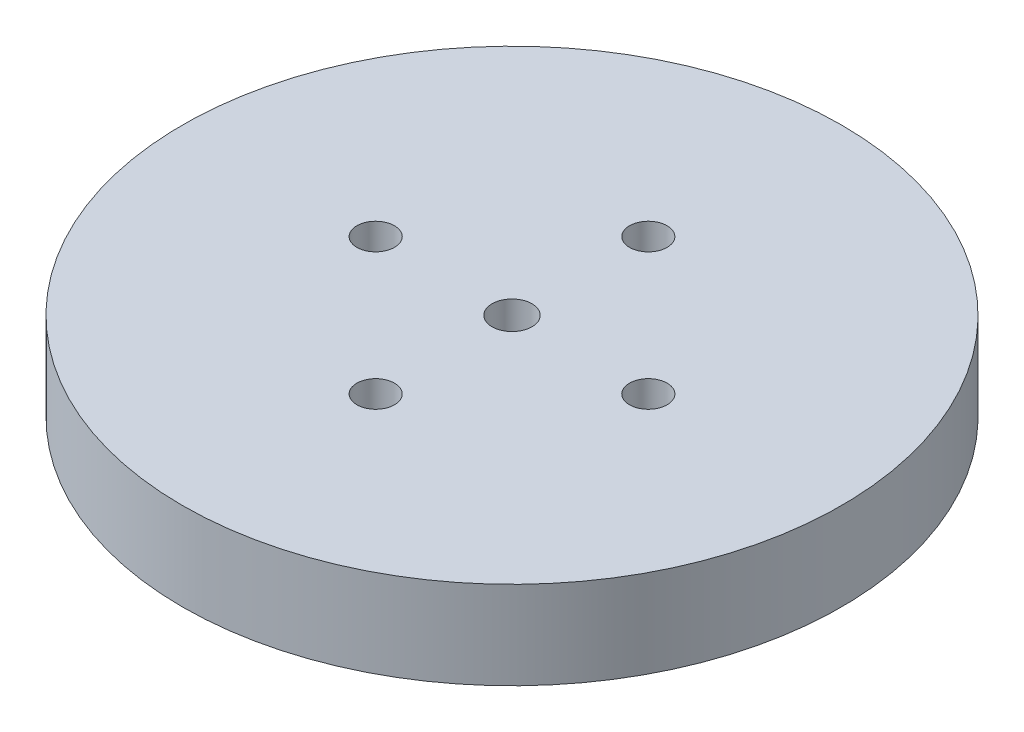
ISO-10303-21;
HEADER;
FILE_DESCRIPTION(('STEP AP214'),'2;1');
FILE_NAME('part.step','',(''),(''),'','','');
FILE_SCHEMA(('AUTOMOTIVE_DESIGN { 1 0 10303 214 1 1 1 1 }'));
ENDSEC;
DATA;
#1=APPLICATION_CONTEXT('core data for automotive mechanical design processes');
#2=APPLICATION_PROTOCOL_DEFINITION('international standard','automotive_design',2000,#1);
#3=PRODUCT_CONTEXT('',#1,'mechanical');
#4=PRODUCT('Part','Part','',(#3));
#5=PRODUCT_RELATED_PRODUCT_CATEGORY('part','',(#4));
#6=PRODUCT_DEFINITION_FORMATION('','',#4);
#7=PRODUCT_DEFINITION_CONTEXT('part definition',#1,'design');
#8=PRODUCT_DEFINITION('design','',#6,#7);
#9=PRODUCT_DEFINITION_SHAPE('','',#8);
#10=(LENGTH_UNIT() NAMED_UNIT(*) SI_UNIT(.MILLI.,.METRE.));
#11=(NAMED_UNIT(*) PLANE_ANGLE_UNIT() SI_UNIT($,.RADIAN.));
#12=(NAMED_UNIT(*) SI_UNIT($,.STERADIAN.) SOLID_ANGLE_UNIT());
#13=UNCERTAINTY_MEASURE_WITH_UNIT(LENGTH_MEASURE(1.E-05),#10,'distance_accuracy_value','');
#14=(GEOMETRIC_REPRESENTATION_CONTEXT(3) GLOBAL_UNCERTAINTY_ASSIGNED_CONTEXT((#13)) GLOBAL_UNIT_ASSIGNED_CONTEXT((#10,
#11,#12)) REPRESENTATION_CONTEXT('',''));
#15=CARTESIAN_POINT('',(0.,0.,0.));
#16=DIRECTION('',(0.,0.,1.));
#17=DIRECTION('',(1.,0.,0.));
#18=AXIS2_PLACEMENT_3D('',#15,#16,#17);
#19=CARTESIAN_POINT('',(0.,22.,0.));
#20=DIRECTION('',(0.,-1.,0.));
#21=DIRECTION('',(0.,0.,-1.));
#22=AXIS2_PLACEMENT_3D('',#19,#20,#21);
#23=CYLINDRICAL_SURFACE('',#22,82.5);
#24=CARTESIAN_POINT('',(0.,22.,0.));
#25=DIRECTION('',(0.,1.,0.));
#26=DIRECTION('',(0.,0.,1.));
#27=AXIS2_PLACEMENT_3D('',#24,#25,#26);
#28=CIRCLE('',#27,82.5);
#29=CARTESIAN_POINT('',(0.,22.,82.5));
#30=VERTEX_POINT('',#29);
#31=EDGE_CURVE('E10',#30,#30,#28,.T.);
#32=ORIENTED_EDGE('',*,*,#31,.F.);
#33=EDGE_LOOP('',(#32));
#34=FACE_BOUND('',#33,.T.);
#35=CARTESIAN_POINT('',(0.,0.,0.));
#36=DIRECTION('',(0.,1.,0.));
#37=DIRECTION('',(0.,0.,1.));
#38=AXIS2_PLACEMENT_3D('',#35,#36,#37);
#39=CIRCLE('',#38,82.5);
#40=CARTESIAN_POINT('',(0.,0.,82.5));
#41=VERTEX_POINT('',#40);
#42=EDGE_CURVE('E37',#41,#41,#39,.T.);
#43=ORIENTED_EDGE('',*,*,#42,.T.);
#44=EDGE_LOOP('',(#43));
#45=FACE_BOUND('',#44,.T.);
#46=ADVANCED_FACE('F40',(#34,#45),#23,.T.);
#47=CARTESIAN_POINT('',(0.,22.,0.));
#48=DIRECTION('',(0.,1.,0.));
#49=DIRECTION('',(0.,0.,1.));
#50=AXIS2_PLACEMENT_3D('',#47,#48,#49);
#51=PLANE('',#50);
#52=CARTESIAN_POINT('',(1.19146316795912E-13,22.,34.1248614077913));
#53=DIRECTION('',(0.,1.,0.));
#54=DIRECTION('',(1.,0.,0.));
#55=AXIS2_PLACEMENT_3D('',#52,#53,#54);
#56=CIRCLE('',#55,4.70463783797581);
#57=CARTESIAN_POINT('',(4.70463783797593,22.,34.1248614077913));
#58=VERTEX_POINT('',#57);
#59=EDGE_CURVE('E71',#58,#58,#56,.T.);
#60=ORIENTED_EDGE('',*,*,#59,.F.);
#61=EDGE_LOOP('',(#60));
#62=FACE_BOUND('',#61,.T.);
#63=CARTESIAN_POINT('',(34.1248614077913,22.,0.));
#64=DIRECTION('',(0.,1.,0.));
#65=DIRECTION('',(0.,0.,-1.));
#66=AXIS2_PLACEMENT_3D('',#63,#64,#65);
#67=CIRCLE('',#66,4.70463783797581);
#68=CARTESIAN_POINT('',(34.1248614077913,22.,-4.70463783797581));
#69=VERTEX_POINT('',#68);
#70=EDGE_CURVE('E70',#69,#69,#67,.T.);
#71=ORIENTED_EDGE('',*,*,#70,.F.);
#72=EDGE_LOOP('',(#71));
#73=FACE_BOUND('',#72,.T.);
#74=CARTESIAN_POINT('',(-3.57438950387735E-13,22.,-34.1248614077913));
#75=DIRECTION('',(0.,1.,0.));
#76=DIRECTION('',(-1.,0.,0.));
#77=AXIS2_PLACEMENT_3D('',#74,#75,#76);
#78=CIRCLE('',#77,4.70463783797581);
#79=CARTESIAN_POINT('',(-4.70463783797616,22.,-34.1248614077913));
#80=VERTEX_POINT('',#79);
#81=EDGE_CURVE('E61',#80,#80,#78,.T.);
#82=ORIENTED_EDGE('',*,*,#81,.F.);
#83=EDGE_LOOP('',(#82));
#84=FACE_BOUND('',#83,.T.);
#85=CARTESIAN_POINT('',(-34.1248614077913,22.,0.));
#86=DIRECTION('',(0.,1.,0.));
#87=DIRECTION('',(0.,0.,1.));
#88=AXIS2_PLACEMENT_3D('',#85,#86,#87);
#89=CIRCLE('',#88,4.70463783797581);
#90=CARTESIAN_POINT('',(-34.1248614077913,22.,4.70463783797581));
#91=VERTEX_POINT('',#90);
#92=EDGE_CURVE('E54',#91,#91,#89,.T.);
#93=ORIENTED_EDGE('',*,*,#92,.F.);
#94=EDGE_LOOP('',(#93));
#95=FACE_BOUND('',#94,.T.);
#96=CARTESIAN_POINT('',(0.,22.,0.));
#97=DIRECTION('',(0.,1.,0.));
#98=DIRECTION('',(0.,0.,1.));
#99=AXIS2_PLACEMENT_3D('',#96,#97,#98);
#100=CIRCLE('',#99,5.);
#101=CARTESIAN_POINT('',(0.,22.,5.));
#102=VERTEX_POINT('',#101);
#103=EDGE_CURVE('E50',#102,#102,#100,.T.);
#104=ORIENTED_EDGE('',*,*,#103,.F.);
#105=EDGE_LOOP('',(#104));
#106=FACE_BOUND('',#105,.T.);
#107=ORIENTED_EDGE('',*,*,#31,.T.);
#108=EDGE_LOOP('',(#107));
#109=FACE_BOUND('',#108,.T.);
#110=ADVANCED_FACE('F86',(#62,#73,#84,#95,#106,#109),#51,.T.);
#111=CARTESIAN_POINT('',(0.,0.,0.));
#112=DIRECTION('',(0.,1.,0.));
#113=DIRECTION('',(0.,0.,1.));
#114=AXIS2_PLACEMENT_3D('',#111,#112,#113);
#115=PLANE('',#114);
#116=CARTESIAN_POINT('',(0.,0.,0.));
#117=DIRECTION('',(0.,1.,0.));
#118=DIRECTION('',(0.,0.,1.));
#119=AXIS2_PLACEMENT_3D('',#116,#117,#118);
#120=CIRCLE('',#119,5.);
#121=CARTESIAN_POINT('',(0.,0.,5.));
#122=VERTEX_POINT('',#121);
#123=EDGE_CURVE('E47',#122,#122,#120,.T.);
#124=ORIENTED_EDGE('',*,*,#123,.T.);
#125=EDGE_LOOP('',(#124));
#126=FACE_BOUND('',#125,.T.);
#127=ORIENTED_EDGE('',*,*,#42,.F.);
#128=EDGE_LOOP('',(#127));
#129=FACE_BOUND('',#128,.T.);
#130=ADVANCED_FACE('F93',(#126,#129),#115,.F.);
#131=CARTESIAN_POINT('',(0.,22.,0.));
#132=DIRECTION('',(0.,-1.,0.));
#133=DIRECTION('',(0.,0.,-1.));
#134=AXIS2_PLACEMENT_3D('',#131,#132,#133);
#135=CYLINDRICAL_SURFACE('',#134,5.);
#136=ORIENTED_EDGE('',*,*,#103,.T.);
#137=EDGE_LOOP('',(#136));
#138=FACE_BOUND('',#137,.T.);
#139=ORIENTED_EDGE('',*,*,#123,.F.);
#140=EDGE_LOOP('',(#139));
#141=FACE_BOUND('',#140,.T.);
#142=ADVANCED_FACE('F101',(#138,#141),#135,.F.);
#143=CARTESIAN_POINT('',(-34.1248614077913,1.17503984854631,0.));
#144=DIRECTION('',(0.,1.,0.));
#145=DIRECTION('',(0.,0.,1.));
#146=AXIS2_PLACEMENT_3D('',#143,#144,#145);
#147=CYLINDRICAL_SURFACE('',#146,4.70463783797581);
#148=CARTESIAN_POINT('',(-34.1248614077913,1.17503984854631,0.));
#149=DIRECTION('',(0.,1.,0.));
#150=DIRECTION('',(0.,0.,1.));
#151=AXIS2_PLACEMENT_3D('',#148,#149,#150);
#152=CIRCLE('',#151,4.70463783797581);
#153=CARTESIAN_POINT('',(-34.1248614077913,1.17503984854631,4.70463783797581));
#154=VERTEX_POINT('',#153);
#155=EDGE_CURVE('E55',#154,#154,#152,.T.);
#156=ORIENTED_EDGE('',*,*,#155,.F.);
#157=EDGE_LOOP('',(#156));
#158=FACE_BOUND('',#157,.T.);
#159=ORIENTED_EDGE('',*,*,#92,.T.);
#160=EDGE_LOOP('',(#159));
#161=FACE_BOUND('',#160,.T.);
#162=ADVANCED_FACE('F102',(#158,#161),#147,.F.);
#163=CARTESIAN_POINT('',(-34.1248614077913,1.17503984854631,0.));
#164=DIRECTION('',(0.,1.,0.));
#165=DIRECTION('',(0.,0.,1.));
#166=AXIS2_PLACEMENT_3D('',#163,#164,#165);
#167=PLANE('',#166);
#168=ORIENTED_EDGE('',*,*,#155,.T.);
#169=EDGE_LOOP('',(#168));
#170=FACE_BOUND('',#169,.T.);
#171=ADVANCED_FACE('F133',(#170),#167,.T.);
#172=CARTESIAN_POINT('',(-3.57438950387735E-13,1.17503984854631,-34.1248614077913));
#173=DIRECTION('',(0.,1.,0.));
#174=DIRECTION('',(0.,0.,1.));
#175=AXIS2_PLACEMENT_3D('',#172,#173,#174);
#176=CYLINDRICAL_SURFACE('',#175,4.70463783797581);
#177=CARTESIAN_POINT('',(-3.57438950387735E-13,1.17503984854631,-34.1248614077913));
#178=DIRECTION('',(0.,1.,0.));
#179=DIRECTION('',(-1.,0.,0.));
#180=AXIS2_PLACEMENT_3D('',#177,#178,#179);
#181=CIRCLE('',#180,4.70463783797581);
#182=CARTESIAN_POINT('',(-4.70463783797616,1.17503984854631,-34.1248614077913));
#183=VERTEX_POINT('',#182);
#184=EDGE_CURVE('E63',#183,#183,#181,.T.);
#185=ORIENTED_EDGE('',*,*,#184,.F.);
#186=EDGE_LOOP('',(#185));
#187=FACE_BOUND('',#186,.T.);
#188=ORIENTED_EDGE('',*,*,#81,.T.);
#189=EDGE_LOOP('',(#188));
#190=FACE_BOUND('',#189,.T.);
#191=ADVANCED_FACE('F142',(#187,#190),#176,.F.);
#192=CARTESIAN_POINT('',(-3.57438950387735E-13,1.17503984854631,-34.1248614077913));
#193=DIRECTION('',(0.,1.,0.));
#194=DIRECTION('',(-1.,0.,0.));
#195=AXIS2_PLACEMENT_3D('',#192,#193,#194);
#196=PLANE('',#195);
#197=ORIENTED_EDGE('',*,*,#184,.T.);
#198=EDGE_LOOP('',(#197));
#199=FACE_BOUND('',#198,.T.);
#200=ADVANCED_FACE('F156',(#199),#196,.T.);
#201=CARTESIAN_POINT('',(34.1248614077913,1.17503984854631,0.));
#202=DIRECTION('',(0.,1.,0.));
#203=DIRECTION('',(0.,0.,1.));
#204=AXIS2_PLACEMENT_3D('',#201,#202,#203);
#205=CYLINDRICAL_SURFACE('',#204,4.70463783797581);
#206=CARTESIAN_POINT('',(34.1248614077913,1.17503984854631,0.));
#207=DIRECTION('',(0.,1.,0.));
#208=DIRECTION('',(0.,0.,-1.));
#209=AXIS2_PLACEMENT_3D('',#206,#207,#208);
#210=CIRCLE('',#209,4.70463783797581);
#211=CARTESIAN_POINT('',(34.1248614077913,1.17503984854631,-4.70463783797581));
#212=VERTEX_POINT('',#211);
#213=EDGE_CURVE('E69',#212,#212,#210,.T.);
#214=ORIENTED_EDGE('',*,*,#213,.F.);
#215=EDGE_LOOP('',(#214));
#216=FACE_BOUND('',#215,.T.);
#217=ORIENTED_EDGE('',*,*,#70,.T.);
#218=EDGE_LOOP('',(#217));
#219=FACE_BOUND('',#218,.T.);
#220=ADVANCED_FACE('F164',(#216,#219),#205,.F.);
#221=CARTESIAN_POINT('',(34.1248614077913,1.17503984854631,0.));
#222=DIRECTION('',(0.,1.,0.));
#223=DIRECTION('',(0.,0.,-1.));
#224=AXIS2_PLACEMENT_3D('',#221,#222,#223);
#225=PLANE('',#224);
#226=ORIENTED_EDGE('',*,*,#213,.T.);
#227=EDGE_LOOP('',(#226));
#228=FACE_BOUND('',#227,.T.);
#229=ADVANCED_FACE('F83',(#228),#225,.T.);
#230=CARTESIAN_POINT('',(1.19146316795912E-13,1.17503984854631,34.1248614077913));
#231=DIRECTION('',(0.,1.,0.));
#232=DIRECTION('',(0.,0.,1.));
#233=AXIS2_PLACEMENT_3D('',#230,#231,#232);
#234=CYLINDRICAL_SURFACE('',#233,4.70463783797581);
#235=CARTESIAN_POINT('',(1.19146316795912E-13,1.17503984854631,34.1248614077913));
#236=DIRECTION('',(0.,1.,0.));
#237=DIRECTION('',(1.,0.,0.));
#238=AXIS2_PLACEMENT_3D('',#235,#236,#237);
#239=CIRCLE('',#238,4.70463783797581);
#240=CARTESIAN_POINT('',(4.70463783797593,1.17503984854631,34.1248614077913));
#241=VERTEX_POINT('',#240);
#242=EDGE_CURVE('E59',#241,#241,#239,.T.);
#243=ORIENTED_EDGE('',*,*,#242,.F.);
#244=EDGE_LOOP('',(#243));
#245=FACE_BOUND('',#244,.T.);
#246=ORIENTED_EDGE('',*,*,#59,.T.);
#247=EDGE_LOOP('',(#246));
#248=FACE_BOUND('',#247,.T.);
#249=ADVANCED_FACE('F81',(#245,#248),#234,.F.);
#250=CARTESIAN_POINT('',(1.19146316795912E-13,1.17503984854631,34.1248614077913));
#251=DIRECTION('',(0.,1.,0.));
#252=DIRECTION('',(1.,0.,0.));
#253=AXIS2_PLACEMENT_3D('',#250,#251,#252);
#254=PLANE('',#253);
#255=ORIENTED_EDGE('',*,*,#242,.T.);
#256=EDGE_LOOP('',(#255));
#257=FACE_BOUND('',#256,.T.);
#258=ADVANCED_FACE('F78',(#257),#254,.T.);
#259=CLOSED_SHELL('',(#46,#110,#130,#142,#162,#171,#191,#200,#220,#229,#249,#258));
#260=MANIFOLD_SOLID_BREP('B2',#259);
#261=ADVANCED_BREP_SHAPE_REPRESENTATION('',(#18,#260),#14);
#262=SHAPE_DEFINITION_REPRESENTATION(#9,#261);
ENDSEC;
END-ISO-10303-21;
